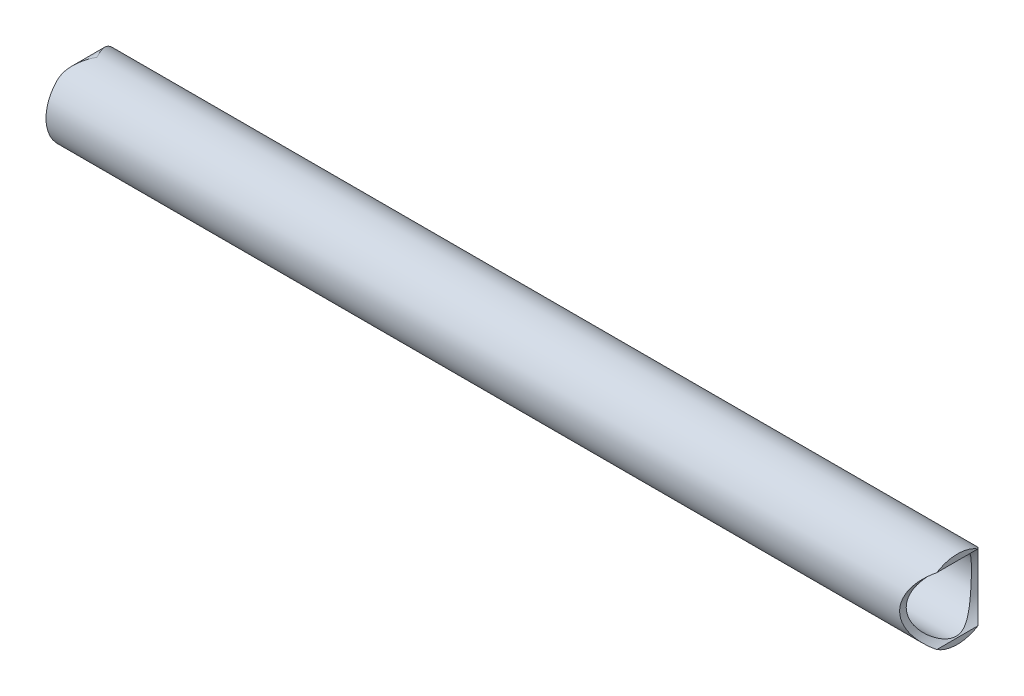
ISO-10303-21;
HEADER;
FILE_DESCRIPTION(('STEP AP214'),'2;1');
FILE_NAME('part.step','',(''),(''),'','','');
FILE_SCHEMA(('AUTOMOTIVE_DESIGN { 1 0 10303 214 1 1 1 1 }'));
ENDSEC;
DATA;
#1=APPLICATION_CONTEXT('core data for automotive mechanical design processes');
#2=APPLICATION_PROTOCOL_DEFINITION('international standard','automotive_design',2000,#1);
#3=PRODUCT_CONTEXT('',#1,'mechanical');
#4=PRODUCT('Part','Part','',(#3));
#5=PRODUCT_RELATED_PRODUCT_CATEGORY('part','',(#4));
#6=PRODUCT_DEFINITION_FORMATION('','',#4);
#7=PRODUCT_DEFINITION_CONTEXT('part definition',#1,'design');
#8=PRODUCT_DEFINITION('design','',#6,#7);
#9=PRODUCT_DEFINITION_SHAPE('','',#8);
#10=(LENGTH_UNIT() NAMED_UNIT(*) SI_UNIT(.MILLI.,.METRE.));
#11=(NAMED_UNIT(*) PLANE_ANGLE_UNIT() SI_UNIT($,.RADIAN.));
#12=(NAMED_UNIT(*) SI_UNIT($,.STERADIAN.) SOLID_ANGLE_UNIT());
#13=UNCERTAINTY_MEASURE_WITH_UNIT(LENGTH_MEASURE(1.E-05),#10,'distance_accuracy_value','');
#14=(GEOMETRIC_REPRESENTATION_CONTEXT(3) GLOBAL_UNCERTAINTY_ASSIGNED_CONTEXT((#13)) GLOBAL_UNIT_ASSIGNED_CONTEXT((#10,
#11,#12)) REPRESENTATION_CONTEXT('',''));
#15=CARTESIAN_POINT('',(0.,0.,0.));
#16=DIRECTION('',(0.,0.,1.));
#17=DIRECTION('',(1.,0.,0.));
#18=AXIS2_PLACEMENT_3D('',#15,#16,#17);
#19=CARTESIAN_POINT('',(469.10625,0.,0.));
#20=DIRECTION('',(1.,0.,0.));
#21=DIRECTION('',(0.,0.,-1.));
#22=AXIS2_PLACEMENT_3D('',#19,#20,#21);
#23=PLANE('',#22);
#24=DIRECTION('',(0.,0.,1.));
#25=VECTOR('',#24,1.);
#26=CARTESIAN_POINT('',(469.10625,17.9154421589309,-21.082));
#27=LINE('',#26,#25);
#28=CARTESIAN_POINT('',(469.10625,17.9154421589309,-11.1125));
#29=VERTEX_POINT('',#28);
#30=CARTESIAN_POINT('',(469.10625,17.915442158931,11.1125));
#31=VERTEX_POINT('',#30);
#32=EDGE_CURVE('E86',#29,#31,#27,.T.);
#33=ORIENTED_EDGE('',*,*,#32,.F.);
#34=CARTESIAN_POINT('',(469.10625,0.,0.));
#35=DIRECTION('',(1.,0.,0.));
#36=DIRECTION('',(0.,0.,-1.));
#37=AXIS2_PLACEMENT_3D('',#34,#35,#36);
#38=CIRCLE('',#37,21.082);
#39=EDGE_CURVE('E46',#29,#31,#38,.T.);
#40=ORIENTED_EDGE('',*,*,#39,.T.);
#41=EDGE_LOOP('',(#33,#40));
#42=FACE_BOUND('',#41,.T.);
#43=ADVANCED_FACE('F32',(#42),#23,.T.);
#44=DIRECTION('',(0.,0.,1.));
#45=VECTOR('',#44,1.);
#46=CARTESIAN_POINT('',(469.10625,-17.9154421589309,-21.082));
#47=LINE('',#46,#45);
#48=CARTESIAN_POINT('',(469.10625,-17.915442158931,11.1125));
#49=VERTEX_POINT('',#48);
#50=CARTESIAN_POINT('',(469.10625,-17.9154421589309,-11.1125));
#51=VERTEX_POINT('',#50);
#52=EDGE_CURVE('E83',#49,#51,#47,.F.);
#53=ORIENTED_EDGE('',*,*,#52,.F.);
#54=EDGE_CURVE('E91',#49,#51,#38,.T.);
#55=ORIENTED_EDGE('',*,*,#54,.T.);
#56=EDGE_LOOP('',(#53,#55));
#57=FACE_BOUND('',#56,.T.);
#58=ADVANCED_FACE('F90',(#57),#23,.T.);
#59=CARTESIAN_POINT('',(0.,0.,0.));
#60=DIRECTION('',(1.,0.,0.));
#61=DIRECTION('',(0.,0.,-1.));
#62=AXIS2_PLACEMENT_3D('',#59,#60,#61);
#63=PLANE('',#62);
#64=CARTESIAN_POINT('',(0.,0.,0.));
#65=DIRECTION('',(1.,0.,0.));
#66=DIRECTION('',(0.,0.,-1.));
#67=AXIS2_PLACEMENT_3D('',#64,#65,#66);
#68=CIRCLE('',#67,21.082);
#69=CARTESIAN_POINT('',(0.,14.732,15.0804144505382));
#70=VERTEX_POINT('',#69);
#71=CARTESIAN_POINT('',(0.,14.732,-15.0804144505382));
#72=VERTEX_POINT('',#71);
#73=EDGE_CURVE('E94',#70,#72,#68,.T.);
#74=ORIENTED_EDGE('',*,*,#73,.F.);
#75=DIRECTION('',(0.,0.,1.));
#76=VECTOR('',#75,1.);
#77=CARTESIAN_POINT('',(0.,14.732,-21.082));
#78=LINE('',#77,#76);
#79=CARTESIAN_POINT('',(0.,14.732,9.49362164824362));
#80=VERTEX_POINT('',#79);
#81=EDGE_CURVE('E122',#80,#70,#78,.T.);
#82=ORIENTED_EDGE('',*,*,#81,.F.);
#83=CARTESIAN_POINT('',(0.,0.,0.));
#84=DIRECTION('',(1.,0.,0.));
#85=DIRECTION('',(0.,0.,-1.));
#86=AXIS2_PLACEMENT_3D('',#83,#84,#85);
#87=CIRCLE('',#86,17.526);
#88=CARTESIAN_POINT('',(0.,14.732,-9.49362164824362));
#89=VERTEX_POINT('',#88);
#90=EDGE_CURVE('E97',#80,#89,#87,.T.);
#91=ORIENTED_EDGE('',*,*,#90,.T.);
#92=EDGE_CURVE('E60',#72,#89,#78,.T.);
#93=ORIENTED_EDGE('',*,*,#92,.F.);
#94=EDGE_LOOP('',(#74,#82,#91,#93));
#95=FACE_BOUND('',#94,.T.);
#96=ADVANCED_FACE('F134',(#95),#63,.F.);
#97=CARTESIAN_POINT('',(469.10625,0.,0.));
#98=DIRECTION('',(-1.,0.,0.));
#99=DIRECTION('',(0.,0.,1.));
#100=AXIS2_PLACEMENT_3D('',#97,#98,#99);
#101=CYLINDRICAL_SURFACE('',#100,21.082);
#102=ORIENTED_EDGE('',*,*,#73,.T.);
#103=CARTESIAN_POINT('',(0.,14.732,-15.0804144505382));
#104=CARTESIAN_POINT('',(4.99777097256306E-06,14.8585166363932,-14.9568250218965));
#105=CARTESIAN_POINT('',(0.0037804024379681,14.9834433145249,-14.8316684363902));
#106=CARTESIAN_POINT('',(0.018344612519162,15.2298802862784,-14.578499414352));
#107=CARTESIAN_POINT('',(0.0291313987626797,15.3513915529794,-14.4504878102679));
#108=CARTESIAN_POINT('',(0.0711641868780703,15.7100653220193,-14.0630095037458));
#109=CARTESIAN_POINT('',(0.112087001365868,15.9418874425845,-13.7995912481011));
#110=CARTESIAN_POINT('',(0.215488507432889,16.3879660671565,-13.2666880799684));
#111=CARTESIAN_POINT('',(0.277765297706076,16.6023646270495,-12.997281336883));
#112=CARTESIAN_POINT('',(0.420807437337394,17.0156387002352,-12.4513482602452));
#113=CARTESIAN_POINT('',(0.501584818248204,17.2145039983668,-12.1748173979638));
#114=CARTESIAN_POINT('',(0.722336490267377,17.6901137279932,-11.4788940830607));
#115=CARTESIAN_POINT('',(0.871915178025879,17.9572278098856,-11.0559422302578));
#116=CARTESIAN_POINT('',(1.19848542775072,18.4567086453977,-10.2003069203716));
#117=CARTESIAN_POINT('',(1.37548494857253,18.6890652721093,-9.76762066916));
#118=CARTESIAN_POINT('',(1.75209895067343,19.1211226362083,-8.89229878891464));
#119=CARTESIAN_POINT('',(1.9518397925665,19.3206241773796,-8.4496197349844));
#120=CARTESIAN_POINT('',(2.36824696498252,19.6862817768882,-7.55863388229215));
#121=CARTESIAN_POINT('',(2.58491234738668,19.8524397012882,-7.11032739995988));
#122=CARTESIAN_POINT('',(3.07854021979459,20.1841782782303,-6.11397748165988));
#123=CARTESIAN_POINT('',(3.35855407719812,20.3421826858222,-5.56492077807607));
#124=CARTESIAN_POINT('',(3.93195657278609,20.6121360645314,-4.46237555433802));
#125=CARTESIAN_POINT('',(4.2253492325938,20.7240710846151,-3.90888574337448));
#126=CARTESIAN_POINT('',(4.81966564824809,20.9026212412311,-2.80091191808466));
#127=CARTESIAN_POINT('',(5.12056407013035,20.9693718110366,-2.24643591433334));
#128=CARTESIAN_POINT('',(5.7263441140806,21.0587059818151,-1.13639917411688));
#129=CARTESIAN_POINT('',(6.0312234277849,21.0813141259917,-0.580839212441869));
#130=CARTESIAN_POINT('',(6.34068566822062,21.0819948744209,-0.0169715207830517));
#131=CARTESIAN_POINT('',(6.34534284661023,21.081999997751,-0.00848573804402203));
#132=CARTESIAN_POINT('',(6.35,21.082,0.));
#133=B_SPLINE_CURVE_WITH_KNOTS('',3,(#103,#104,#105,#106,#107,#108,#109,#110,#111,#112,#113,
#114,#115,#116,#117,#118,#119,#120,#121,#122,#123,#124,#125,#126,#127,#128,#129,#130,#131,#132),
.UNSPECIFIED.,.F.,.F.,(4,2,2,2,2,2,2,2,2,2,2,2,2,2,4),(0.,0.530465682198346,1.06077866603508,
2.11923257632368,3.16794284977036,4.21733708093636,5.78132496799527,7.34576765361523,
8.91937150261676,10.4928872609037,12.3996794344843,14.3070486112538,16.2086751300639,
18.1092440424708,18.1382833302831),.UNSPECIFIED.);
#134=CARTESIAN_POINT('',(6.35,21.082,0.));
#135=VERTEX_POINT('',#134);
#136=EDGE_CURVE('E121',#72,#135,#133,.T.);
#137=ORIENTED_EDGE('',*,*,#136,.T.);
#138=CARTESIAN_POINT('',(0.,14.732,15.0804144505382));
#139=CARTESIAN_POINT('',(4.99777097265902E-06,14.8585166363932,14.9568250218965));
#140=CARTESIAN_POINT('',(0.00378040243796859,14.983443314525,14.8316684363902));
#141=CARTESIAN_POINT('',(0.0183446125191639,15.2298802862785,14.5784994143519));
#142=CARTESIAN_POINT('',(0.0291313987626825,15.3513915529794,14.4504878102678));
#143=CARTESIAN_POINT('',(0.071164186878077,15.7100653220194,14.0630095037458));
#144=CARTESIAN_POINT('',(0.112087001365878,15.9418874425845,13.799591248101));
#145=CARTESIAN_POINT('',(0.215488507432905,16.3879660671565,13.2666880799683));
#146=CARTESIAN_POINT('',(0.277765297706091,16.6023646270495,12.9972813368829));
#147=CARTESIAN_POINT('',(0.420807437337405,17.0156387002352,12.4513482602451));
#148=CARTESIAN_POINT('',(0.501584818248212,17.2145039983668,12.1748173979638));
#149=CARTESIAN_POINT('',(0.722336490267378,17.6901137279932,11.4788940830607));
#150=CARTESIAN_POINT('',(0.871915178025876,17.9572278098856,11.0559422302578));
#151=CARTESIAN_POINT('',(1.19848542775071,18.4567086453976,10.2003069203717));
#152=CARTESIAN_POINT('',(1.37548494857251,18.6890652721093,9.76762066916005));
#153=CARTESIAN_POINT('',(1.75209895067341,19.1211226362082,8.89229878891469));
#154=CARTESIAN_POINT('',(1.95183979256649,19.3206241773795,8.44961973498444));
#155=CARTESIAN_POINT('',(2.36824696498251,19.6862817768881,7.55863388229216));
#156=CARTESIAN_POINT('',(2.58491234738667,19.8524397012882,7.11032739995988));
#157=CARTESIAN_POINT('',(3.0785402197946,20.1841782782303,6.11397748165988));
#158=CARTESIAN_POINT('',(3.35855407719814,20.3421826858222,5.56492077807609));
#159=CARTESIAN_POINT('',(3.93195657278606,20.6121360645314,4.462375554338));
#160=CARTESIAN_POINT('',(4.22534923259369,20.7240710846151,3.90888574337441));
#161=CARTESIAN_POINT('',(4.81966564824822,20.9026212412311,2.80091191808473));
#162=CARTESIAN_POINT('',(5.12056407013078,20.9693718110366,2.24643591433359));
#163=CARTESIAN_POINT('',(5.72634411408013,21.0587059818151,1.13639917411665));
#164=CARTESIAN_POINT('',(6.03122342778322,21.0813141259917,0.580839212440988));
#165=CARTESIAN_POINT('',(6.34068566822056,21.0819948744209,0.0169715207830728));
#166=CARTESIAN_POINT('',(6.3453428466102,21.081999997751,0.00848573804405541));
#167=CARTESIAN_POINT('',(6.35,21.082,0.));
#168=B_SPLINE_CURVE_WITH_KNOTS('',3,(#138,#139,#140,#141,#142,#143,#144,#145,#146,#147,#148,
#149,#150,#151,#152,#153,#154,#155,#156,#157,#158,#159,#160,#161,#162,#163,#164,#165,#166,#167),
.UNSPECIFIED.,.F.,.F.,(4,2,2,2,2,2,2,2,2,2,2,2,2,2,4),(0.,0.530465682198373,1.06077866603513,
2.11923257632378,3.16794284977042,4.21733708093637,5.78132496799524,7.34576765361516,
8.91937150261673,10.4928872609037,12.3996794344843,14.3070486112539,16.2086751300639,
18.1092440424708,18.1382833302831),.UNSPECIFIED.);
#169=EDGE_CURVE('E115',#135,#70,#168,.F.);
#170=ORIENTED_EDGE('',*,*,#169,.T.);
#171=EDGE_LOOP('',(#102,#137,#170));
#172=FACE_BOUND('',#171,.T.);
#173=ORIENTED_EDGE('',*,*,#39,.F.);
#174=CARTESIAN_POINT('',(480.21875,0.,0.));
#175=DIRECTION('',(-0.707106781186548,0.,0.707106781186547));
#176=DIRECTION('',(-0.707106781186548,0.,-0.707106781186547));
#177=AXIS2_PLACEMENT_3D('',#174,#175,#176);
#178=ELLIPSE('',#177,29.8144503219496,21.082);
#179=EDGE_CURVE('E93',#29,#51,#178,.T.);
#180=ORIENTED_EDGE('',*,*,#179,.T.);
#181=ORIENTED_EDGE('',*,*,#54,.F.);
#182=CARTESIAN_POINT('',(480.21875,0.,0.));
#183=DIRECTION('',(-0.707106781186548,0.,-0.707106781186547));
#184=DIRECTION('',(-0.707106781186548,0.,0.707106781186547));
#185=AXIS2_PLACEMENT_3D('',#182,#183,#184);
#186=ELLIPSE('',#185,29.8144503219496,21.082);
#187=EDGE_CURVE('E53',#49,#31,#186,.T.);
#188=ORIENTED_EDGE('',*,*,#187,.T.);
#189=EDGE_LOOP('',(#173,#180,#181,#188));
#190=FACE_BOUND('',#189,.T.);
#191=ADVANCED_FACE('F34',(#172,#190),#101,.T.);
#192=CARTESIAN_POINT('',(469.10625,0.,0.));
#193=DIRECTION('',(-1.,0.,0.));
#194=DIRECTION('',(0.,0.,1.));
#195=AXIS2_PLACEMENT_3D('',#192,#193,#194);
#196=CYLINDRICAL_SURFACE('',#195,17.526);
#197=CARTESIAN_POINT('',(459.13675,0.,17.526));
#198=CARTESIAN_POINT('',(459.136753100232,0.416555730228906,17.525996813955));
#199=CARTESIAN_POINT('',(459.149123313981,0.833163012071545,17.5111221446535));
#200=CARTESIAN_POINT('',(459.198320724751,1.66285085098589,17.4518957288154));
#201=CARTESIAN_POINT('',(459.235152005793,2.0759308074684,17.4075390599622));
#202=CARTESIAN_POINT('',(459.332452439066,2.89546158233793,17.2901260170745));
#203=CARTESIAN_POINT('',(459.392938843433,3.30190733638105,17.2170486963236));
#204=CARTESIAN_POINT('',(459.536212942405,4.10484124386305,17.0434647188049));
#205=CARTESIAN_POINT('',(459.619000210819,4.50132958743919,16.9429585862272));
#206=CARTESIAN_POINT('',(459.804608337995,5.27944797465432,16.7167963170662));
#207=CARTESIAN_POINT('',(459.907303655403,5.66115402240748,16.5912976561353));
#208=CARTESIAN_POINT('',(460.13114125938,6.41026860382347,16.3165047587702));
#209=CARTESIAN_POINT('',(460.252283245215,6.77767737045173,16.1672109102661));
#210=CARTESIAN_POINT('',(460.510997114563,7.49674702968466,15.8465909890381));
#211=CARTESIAN_POINT('',(460.648570010029,7.84840695050787,15.6752635592522));
#212=CARTESIAN_POINT('',(460.938082247339,8.53495429518089,15.3122852034019));
#213=CARTESIAN_POINT('',(461.090024633481,8.86983814178559,15.1206299696701));
#214=CARTESIAN_POINT('',(461.464140089599,9.64160099861961,14.6449374869007));
#215=CARTESIAN_POINT('',(461.691652769384,10.0709113512938,14.3527749107548));
#216=CARTESIAN_POINT('',(462.164488465582,10.8958978241818,13.7370028939555));
#217=CARTESIAN_POINT('',(462.409817485787,11.2915625079794,13.4133828401386));
#218=CARTESIAN_POINT('',(462.913798875036,12.049775776248,12.7366579401323));
#219=CARTESIAN_POINT('',(463.17248335067,12.4122381349312,12.3834806406871));
#220=CARTESIAN_POINT('',(463.697391944567,13.102805813699,11.6503545982694));
#221=CARTESIAN_POINT('',(463.963615114459,13.4309154311957,11.2704092138659));
#222=CARTESIAN_POINT('',(464.503016862729,14.0584742968281,10.4776077506457));
#223=CARTESIAN_POINT('',(464.776233749344,14.3572918160694,10.0642778803075));
#224=CARTESIAN_POINT('',(465.318313078632,14.9191165849368,9.21095532717234));
#225=CARTESIAN_POINT('',(465.587174038226,15.1821118547605,8.77095379548327));
#226=CARTESIAN_POINT('',(466.111691041438,15.6706637077535,7.86481925902692));
#227=CARTESIAN_POINT('',(466.367377460908,15.8963093356672,7.39875205622169));
#228=CARTESIAN_POINT('',(466.855669817722,16.3089147666568,6.43838077354218));
#229=CARTESIAN_POINT('',(467.088295378546,16.4959076106971,5.94410127510899));
#230=CARTESIAN_POINT('',(467.419892415188,16.7529770224336,5.15602712210236));
#231=CARTESIAN_POINT('',(467.531806838252,16.837735543251,4.872411200417));
#232=CARTESIAN_POINT('',(467.741705453925,16.9938564773723,4.29634473218566));
#233=CARTESIAN_POINT('',(467.83968784338,17.0652171570416,4.00389304799845));
#234=CARTESIAN_POINT('',(468.018453347219,17.1934754104678,3.41127303424146));
#235=CARTESIAN_POINT('',(468.099269928926,17.2504011700851,3.11112102298287));
#236=CARTESIAN_POINT('',(468.240783138788,17.3489622258268,2.503748224318));
#237=CARTESIAN_POINT('',(468.301490351692,17.3906055672393,2.19653124698383));
#238=CARTESIAN_POINT('',(468.400642338332,17.4581424184477,1.57275012439623));
#239=CARTESIAN_POINT('',(468.438798088988,17.4838316609619,1.25611705495765));
#240=CARTESIAN_POINT('',(468.489564384314,17.517930419636,0.619877416859227));
#241=CARTESIAN_POINT('',(468.502177230519,17.526341492641,0.300271118708478));
#242=CARTESIAN_POINT('',(468.501123738161,17.5256372212721,-0.338900631657943));
#243=CARTESIAN_POINT('',(468.487455708289,17.5165207489109,-0.658466079921118));
#244=CARTESIAN_POINT('',(468.434638550502,17.4810304342677,-1.29450990358539));
#245=CARTESIAN_POINT('',(468.395486264212,17.454654452937,-1.61098789140883));
#246=CARTESIAN_POINT('',(468.289324257895,17.3822895125155,-2.26597180787558));
#247=CARTESIAN_POINT('',(468.220160695607,17.3347748801548,-2.6039563959663));
#248=CARTESIAN_POINT('',(468.05798050578,17.2213863424108,-3.27094152568147));
#249=CARTESIAN_POINT('',(467.964960013026,17.1555094618906,-3.59994060193884));
#250=CARTESIAN_POINT('',(467.758998964524,17.0065131076897,-4.24855727345));
#251=CARTESIAN_POINT('',(467.64600613574,16.9233482836622,-4.56814761827544));
#252=CARTESIAN_POINT('',(467.404253660727,16.7410384013215,-5.19667563423267));
#253=CARTESIAN_POINT('',(467.275487866865,16.6418871073676,-5.50560909125264));
#254=CARTESIAN_POINT('',(466.927147015409,16.3663636741079,-6.28987340285503));
#255=CARTESIAN_POINT('',(466.698405644521,16.1786783054546,-6.75718011774374));
#256=CARTESIAN_POINT('',(466.221976191773,15.7683263145676,-7.66612047395263));
#257=CARTESIAN_POINT('',(465.974277188512,15.5456394491178,-8.10773905469757));
#258=CARTESIAN_POINT('',(465.468372952079,15.0664754392744,-8.96683638051191));
#259=CARTESIAN_POINT('',(465.21015403316,14.8099532398125,-9.38428185098054));
#260=CARTESIAN_POINT('',(464.690466965766,14.2641231324516,-10.1948087082538));
#261=CARTESIAN_POINT('',(464.428999471574,13.9748217341554,-10.5878949086503));
#262=CARTESIAN_POINT('',(463.895324879337,13.348195218157,-11.368790869149));
#263=CARTESIAN_POINT('',(463.623240901127,13.0091843032674,-11.7553355433847));
#264=CARTESIAN_POINT('',(463.087541373633,12.2951909614096,-12.5002060187878));
#265=CARTESIAN_POINT('',(462.823927094039,11.9202031744408,-12.8585276006225));
#266=CARTESIAN_POINT('',(462.311174827839,11.1350258886843,-13.5441070863272));
#267=CARTESIAN_POINT('',(462.062010084927,10.7249051788906,-13.8714231651622));
#268=CARTESIAN_POINT('',(461.7029705029,10.0834868401277,-14.3371461507588));
#269=CARTESIAN_POINT('',(461.585752726259,9.8653306424743,-14.4881649831134));
#270=CARTESIAN_POINT('',(461.356837871324,9.42027707168284,-14.7814103315513));
#271=CARTESIAN_POINT('',(461.245142151037,9.19337757252926,-14.9236346869964));
#272=CARTESIAN_POINT('',(460.973493112914,8.61498224084044,-15.2678084182525));
#273=CARTESIAN_POINT('',(460.817459068209,8.25811349099297,-15.4639027842676));
#274=CARTESIAN_POINT('',(460.521964191443,7.52616004996061,-15.8330525436508));
#275=CARTESIAN_POINT('',(460.382499423159,7.15107971509298,-16.0061134100713));
#276=CARTESIAN_POINT('',(460.122537175912,6.38410638575886,-16.3271734823368));
#277=CARTESIAN_POINT('',(460.00203301395,5.99221937735624,-16.4751815198914));
#278=CARTESIAN_POINT('',(459.782250109816,5.19343454244432,-16.7441479493523));
#279=CARTESIAN_POINT('',(459.682971726726,4.78653646212599,-16.8651058836479));
#280=CARTESIAN_POINT('',(459.507089403541,3.95712937963007,-17.0788335101842));
#281=CARTESIAN_POINT('',(459.430663185674,3.53452536865489,-17.1713824047497));
#282=CARTESIAN_POINT('',(459.30330895774,2.67986601870688,-17.325342710614));
#283=CARTESIAN_POINT('',(459.252380994275,2.24781066246181,-17.3867540650041));
#284=CARTESIAN_POINT('',(459.177324216148,1.37821649825806,-17.4771905064637));
#285=CARTESIAN_POINT('',(459.153182158585,0.940680508218323,-17.5062315973617));
#286=CARTESIAN_POINT('',(459.132290012414,0.0640313485043037,-17.5313661812511));
#287=CARTESIAN_POINT('',(459.135537074792,-0.37508165237985,-17.5274631010918));
#288=CARTESIAN_POINT('',(459.167335633984,-1.19930498558239,-17.4891990815668));
#289=CARTESIAN_POINT('',(459.192874675364,-1.58470875998572,-17.4584640327402));
#290=CARTESIAN_POINT('',(459.264684232639,-2.35069997583225,-17.3719144045829));
#291=CARTESIAN_POINT('',(459.310952802018,-2.73128786604044,-17.3161021800126));
#292=CARTESIAN_POINT('',(459.42332254399,-3.48513791526224,-17.1802563891461));
#293=CARTESIAN_POINT('',(459.489424907109,-3.85839963308743,-17.1002213688688));
#294=CARTESIAN_POINT('',(459.64024630486,-4.59536738648546,-16.9170761014037));
#295=CARTESIAN_POINT('',(459.724966273857,-4.95907294143571,-16.813964696073));
#296=CARTESIAN_POINT('',(459.913145504431,-5.68108005964255,-16.5840874699882));
#297=CARTESIAN_POINT('',(460.016895992016,-6.03918783157445,-16.4569529541794));
#298=CARTESIAN_POINT('',(460.240467917882,-6.74203119401674,-16.1817226350541));
#299=CARTESIAN_POINT('',(460.360289050715,-7.08676703852215,-16.033627230131));
#300=CARTESIAN_POINT('',(460.614268706947,-7.7617711253795,-15.7179651464271));
#301=CARTESIAN_POINT('',(460.748429245294,-8.09203732526567,-15.5503957309038));
#302=CARTESIAN_POINT('',(461.029307650088,-8.73727082208682,-15.1972398091077));
#303=CARTESIAN_POINT('',(461.176028031205,-9.05223503545283,-15.0116496938153));
#304=CARTESIAN_POINT('',(461.548812920572,-9.80464712063615,-14.5364034891831));
#305=CARTESIAN_POINT('',(461.780846995919,-10.2333578451482,-14.2375288779349));
#306=CARTESIAN_POINT('',(462.262358234905,-11.0565036944503,-13.6081978996813));
#307=CARTESIAN_POINT('',(462.511842112484,-11.4509254939542,-13.2777293585403));
#308=CARTESIAN_POINT('',(463.023748955069,-12.2062013475731,-12.5869774042746));
#309=CARTESIAN_POINT('',(463.286207884647,-12.5669530526875,-12.2266089972621));
#310=CARTESIAN_POINT('',(463.817996141297,-13.253470559835,-11.4788424530418));
#311=CARTESIAN_POINT('',(464.08732447637,-13.5792413783913,-11.091448204724));
#312=CARTESIAN_POINT('',(464.631962798302,-14.2012900820747,-10.2834169092844));
#313=CARTESIAN_POINT('',(464.907294003942,-14.4969406813881,-9.8623113113111));
#314=CARTESIAN_POINT('',(465.452322074852,-15.0517275612925,-8.99289776114401));
#315=CARTESIAN_POINT('',(465.722016777624,-15.3108500388738,-8.54457961710635));
#316=CARTESIAN_POINT('',(466.246222682617,-15.7906628138659,-7.62139093429989));
#317=CARTESIAN_POINT('',(466.500775922646,-16.0114631279653,-7.14660175430663));
#318=CARTESIAN_POINT('',(466.984149383237,-16.4132437140876,-6.16809279152978));
#319=CARTESIAN_POINT('',(467.212994501134,-16.5942626782093,-5.6644017261431));
#320=CARTESIAN_POINT('',(467.533166365567,-16.8388425611419,-4.86810478458098));
#321=CARTESIAN_POINT('',(467.63901918611,-16.9179225696371,-4.58604260557915));
#322=CARTESIAN_POINT('',(467.836250596365,-17.062806654192,-4.01353560636163));
#323=CARTESIAN_POINT('',(467.92763123726,-17.1286126119829,-3.72309198098292));
#324=CARTESIAN_POINT('',(468.092782938295,-17.2459247048064,-3.13503376582409));
#325=CARTESIAN_POINT('',(468.166590343537,-17.2974603903694,-2.83743540296246));
#326=CARTESIAN_POINT('',(468.29389080646,-17.3854671554674,-2.23575303013736));
#327=CARTESIAN_POINT('',(468.347389138256,-17.4219421463683,-1.93167072569972));
#328=CARTESIAN_POINT('',(468.432050986908,-17.4793343349965,-1.31542257105261));
#329=CARTESIAN_POINT('',(468.462959056324,-17.5000736934338,-1.00320440672016));
#330=CARTESIAN_POINT('',(468.499785417953,-17.524756770186,-0.376634351053846));
#331=CARTESIAN_POINT('',(468.505705534394,-17.5287017145648,-0.0622826171578791));
#332=CARTESIAN_POINT('',(468.492219236601,-17.519682115217,0.565765427557123));
#333=CARTESIAN_POINT('',(468.472801625762,-17.5067100959756,0.87946138722474));
#334=CARTESIAN_POINT('',(468.409708218613,-17.4642111799082,1.50326166249684));
#335=CARTESIAN_POINT('',(468.366029014212,-17.4346819572413,1.8133654672525));
#336=CARTESIAN_POINT('',(468.24947913328,-17.3549094765865,2.46783373112703));
#337=CARTESIAN_POINT('',(468.173539424602,-17.302463431889,2.81137909094881));
#338=CARTESIAN_POINT('',(467.99769360765,-17.1787080018257,3.48874159064592));
#339=CARTESIAN_POINT('',(467.897782550923,-17.1073947213456,3.82255670590954));
#340=CARTESIAN_POINT('',(467.678186596836,-16.947078987979,4.48018532937914));
#341=CARTESIAN_POINT('',(467.55845074705,-16.8580308311813,4.80397044519033));
#342=CARTESIAN_POINT('',(467.303531095877,-16.6635408359202,5.44039078400235));
#343=CARTESIAN_POINT('',(467.168341323107,-16.5580926547885,5.75302163536546));
#344=CARTESIAN_POINT('',(466.803678142386,-16.2655608949425,6.54686642927639));
#345=CARTESIAN_POINT('',(466.565311783285,-16.0668060807317,7.0197186237903));
#346=CARTESIAN_POINT('',(466.070778251224,-15.6331071713109,7.93883090279246));
#347=CARTESIAN_POINT('',(465.814601013657,-15.3981425218364,8.38507568297595));
#348=CARTESIAN_POINT('',(465.292991177891,-14.8931005076266,9.25247800104897));
#349=CARTESIAN_POINT('',(465.027546784682,-14.6229771058186,9.67360157184695));
#350=CARTESIAN_POINT('',(464.49479644847,-14.0485414814654,10.4903942108924));
#351=CARTESIAN_POINT('',(464.227490886297,-13.7442360709218,10.8860683262347));
#352=CARTESIAN_POINT('',(463.685008627962,-13.0872302237909,11.6686564771624));
#353=CARTESIAN_POINT('',(463.410011314537,-12.7329783860628,12.0543962817461));
#354=CARTESIAN_POINT('',(462.870324829164,-11.9872775461265,12.7961902436962));
#355=CARTESIAN_POINT('',(462.60563734665,-11.5958224834142,13.1522395466039));
#356=CARTESIAN_POINT('',(462.092856716602,-10.776623787392,13.8313916713883));
#357=CARTESIAN_POINT('',(461.844731277596,-10.3489546907981,14.1545592898452));
#358=CARTESIAN_POINT('',(461.489058671317,-9.6805538418048,14.6123392874479));
#359=CARTESIAN_POINT('',(461.373266967441,-9.45330032462178,14.7604208100894));
#360=CARTESIAN_POINT('',(461.147843154438,-8.98986303225831,15.0471693205303));
#361=CARTESIAN_POINT('',(461.03821252428,-8.7536771354263,15.1858340494738));
#362=CARTESIAN_POINT('',(460.777882456114,-8.16388969440334,15.5135810654738));
#363=CARTESIAN_POINT('',(460.631019615212,-7.80547285234025,15.6971201066552));
#364=CARTESIAN_POINT('',(460.354258282389,-7.07152507053722,16.0411475968501));
#365=CARTESIAN_POINT('',(460.224355748624,-6.69599823719479,16.2016415386992));
#366=CARTESIAN_POINT('',(459.983865788701,-5.92969186792639,16.4975121757086));
#367=CARTESIAN_POINT('',(459.873255954141,-5.53893068115682,16.6329180221441));
#368=CARTESIAN_POINT('',(459.673317296928,-4.74382214338575,16.8768969338328));
#369=CARTESIAN_POINT('',(459.583984673672,-4.33947723349805,16.9854747913174));
#370=CARTESIAN_POINT('',(459.445844180231,-3.61139042732534,17.1529959877094));
#371=CARTESIAN_POINT('',(459.392441530083,-3.2898093654496,17.2176086822695));
#372=CARTESIAN_POINT('',(459.300313709527,-2.64139463379433,17.3289327236608));
#373=CARTESIAN_POINT('',(459.261591366206,-2.31455996491102,17.3756406224611));
#374=CARTESIAN_POINT('',(459.199400717763,-1.657300955975,17.4505998410856));
#375=CARTESIAN_POINT('',(459.175933854947,-1.32687627951213,17.4788494157967));
#376=CARTESIAN_POINT('',(459.144609151471,-0.66431170552806,17.5165484873698));
#377=CARTESIAN_POINT('',(459.136747527795,-0.332172243283639,17.5260025406341));
#378=CARTESIAN_POINT('',(459.13675,0.,17.526));
#379=B_SPLINE_CURVE_WITH_KNOTS('',3,(#197,#198,#199,#200,#201,#202,#203,#204,#205,#206,#207,
#208,#209,#210,#211,#212,#213,#214,#215,#216,#217,#218,#219,#220,#221,#222,#223,#224,#225,#226,
#227,#228,#229,#230,#231,#232,#233,#234,#235,#236,#237,#238,#239,#240,#241,#242,#243,#244,#245,
#246,#247,#248,#249,#250,#251,#252,#253,#254,#255,#256,#257,#258,#259,#260,#261,#262,#263,#264,
#265,#266,#267,#268,#269,#270,#271,#272,#273,#274,#275,#276,#277,#278,#279,#280,#281,#282,#283,
#284,#285,#286,#287,#288,#289,#290,#291,#292,#293,#294,#295,#296,#297,#298,#299,#300,#301,#302,
#303,#304,#305,#306,#307,#308,#309,#310,#311,#312,#313,#314,#315,#316,#317,#318,#319,#320,#321,
#322,#323,#324,#325,#326,#327,#328,#329,#330,#331,#332,#333,#334,#335,#336,#337,#338,#339,#340,
#341,#342,#343,#344,#345,#346,#347,#348,#349,#350,#351,#352,#353,#354,#355,#356,#357,#358,#359,
#360,#361,#362,#363,#364,#365,#366,#367,#368,#369,#370,#371,#372,#373,#374,#375,#376,#377,#378),
.UNSPECIFIED.,.T.,.F.,(4,2,2,2,2,2,2,2,2,2,2,2,2,2,2,2,2,2,2,2,2,2,2,2,2,2,2,2,2,2,2,2,2,2,2,2,
2,2,2,2,2,2,2,2,2,2,2,2,2,2,2,2,2,2,2,2,2,2,2,2,2,2,2,2,2,2,2,2,2,2,2,2,2,2,2,2,2,2,2,2,2,2,2,2,
2,2,2,2,2,2,4),(0.,1.24931215514068,2.49883294793602,3.74926674484587,4.99967664647633,
6.24244384055415,7.48519077601582,8.72801428973392,9.97110169852848,11.6694991969452,
13.3684717049052,15.0717382323203,16.7747914316099,18.508900041403,20.2435871614538,
21.974077138334,23.7030816933734,24.6518793950268,25.6007997833557,26.5478527733324,
27.4944064783684,28.4528421356183,29.4111914294722,30.3696024000782,31.3281321733839,
32.3712679495731,33.4145728378166,34.4606499010713,35.5071359859366,37.1638893836605,
38.8216045193316,40.4815497807695,42.1411659704712,43.8844508919193,45.6279959405214,
47.3682019789461,48.238133531576,49.1082779678088,50.4151915777868,51.7217940919451,
53.0279350344375,54.3340980714494,55.6501696985348,56.9662437309291,58.2816668085292,
59.5969530576398,60.7579780281908,61.9188940006416,63.0798796712698,64.240923621771,
65.4214962902465,66.6020465231705,67.7827628635306,68.9637161565106,70.6766447530631,
72.3902360758568,74.1088773225334,75.8272717729951,77.5762157648221,79.3258188748362,
81.0703129492533,82.8131027115062,83.7469352207905,84.6806352566832,85.6123870984828,
86.5438968054863,87.4857834704328,88.4276013724583,89.3698355997799,90.3122022187916,
91.3777285366849,92.4434750028669,93.5120043575646,94.5809479956882,96.2751844313667,
97.9703861554526,99.6678303471317,101.364936859805,103.137598327809,104.910549063673,
106.679935458133,107.564410898222,108.449097758104,109.733689326203,111.01797419982,
112.300757301213,113.58331109564,114.579500372221,115.575881394522,116.57235660447,
117.568590219854),.UNSPECIFIED.);
#380=CARTESIAN_POINT('',(459.13675,0.,17.526));
#381=VERTEX_POINT('',#380);
#382=EDGE_CURVE('E37',#381,#381,#379,.T.);
#383=ORIENTED_EDGE('',*,*,#382,.F.);
#384=EDGE_LOOP('',(#383));
#385=FACE_BOUND('',#384,.T.);
#386=CARTESIAN_POINT('',(0.,14.732,-9.49362164824361));
#387=CARTESIAN_POINT('',(1.18215827092096E-05,14.8512065552147,-9.30864758850528));
#388=CARTESIAN_POINT('',(0.00335629290756961,14.966903733683,-9.12145207419103));
#389=CARTESIAN_POINT('',(0.015618373053566,15.191067778283,-8.74302268186063));
#390=CARTESIAN_POINT('',(0.024534469369689,15.2995365978256,-8.55178991342886));
#391=CARTESIAN_POINT('',(0.0468365894807759,15.5089823218411,-8.16580160022169));
#392=CARTESIAN_POINT('',(0.0602176995159619,15.6099673136364,-7.97105014964136));
#393=CARTESIAN_POINT('',(0.0904463086584942,15.8044598611726,-7.57811282719616));
#394=CARTESIAN_POINT('',(0.107294062917175,15.8979668658161,-7.3799267035169));
#395=CARTESIAN_POINT('',(0.161710749515973,16.1677428894095,-6.77922295697602));
#396=CARTESIAN_POINT('',(0.203066270989696,16.3325710230985,-6.37184299640371));
#397=CARTESIAN_POINT('',(0.28865530712156,16.6311343918077,-5.5460775193833));
#398=CARTESIAN_POINT('',(0.332889819449679,16.7648587740876,-5.12768821805969));
#399=CARTESIAN_POINT('',(0.420233364203613,17.0075279308424,-4.25683335736751));
#400=CARTESIAN_POINT('',(0.463124929061231,17.1145638855675,-3.80380674958994));
#401=CARTESIAN_POINT('',(0.519476718498732,17.2479052083383,-3.11843895481312));
#402=CARTESIAN_POINT('',(0.536930761583319,17.2878189125596,-2.88899376313145));
#403=CARTESIAN_POINT('',(0.568518618471742,17.3584967782642,-2.42847866805183));
#404=CARTESIAN_POINT('',(0.582652788803805,17.3892619223255,-2.19740894186361));
#405=CARTESIAN_POINT('',(0.60700831203503,17.4414967310561,-1.73463327297525));
#406=CARTESIAN_POINT('',(0.617239840917754,17.4629905896764,-1.50293059363321));
#407=CARTESIAN_POINT('',(0.633438941414769,17.4967389939057,-1.03872466306625));
#408=CARTESIAN_POINT('',(0.639406934130212,17.5089944519799,-0.806221493184098));
#409=CARTESIAN_POINT('',(0.646841906691908,17.5242321079992,-0.340835958369956));
#410=CARTESIAN_POINT('',(0.648308834845186,17.5272141994432,-0.107953589113738));
#411=CARTESIAN_POINT('',(0.646683444701061,17.5238958672413,0.357727673351307));
#412=CARTESIAN_POINT('',(0.64359113409545,17.5175954592557,0.590526566700303));
#413=CARTESIAN_POINT('',(0.633015011982841,17.4958254842557,1.05357258230511));
#414=CARTESIAN_POINT('',(0.625569519654457,17.4804359133699,1.28382432502859));
#415=CARTESIAN_POINT('',(0.606616305295421,17.4405997328694,1.74338121783046));
#416=CARTESIAN_POINT('',(0.595108185917324,17.416152237328,1.97268627309738));
#417=CARTESIAN_POINT('',(0.555116369049375,17.3293085585805,2.65858155894497));
#418=CARTESIAN_POINT('',(0.521163416818214,17.2534079290171,3.11322070575031));
#419=CARTESIAN_POINT('',(0.443683996229778,17.0661243267718,4.01506176899039));
#420=CARTESIAN_POINT('',(0.400139881988926,16.9546757811965,4.4622483212256));
#421=CARTESIAN_POINT('',(0.31015365623528,16.6970370744889,5.34616265629826));
#422=CARTESIAN_POINT('',(0.263712022198695,16.5508526263209,5.78289214600579));
#423=CARTESIAN_POINT('',(0.190296116221632,16.2789916862365,6.49992819615105));
#424=CARTESIAN_POINT('',(0.162003200675152,16.1627907207943,6.78372963515089));
#425=CARTESIAN_POINT('',(0.109990072823221,15.9155254057193,7.34511810644267));
#426=CARTESIAN_POINT('',(0.0862682339282398,15.7844663697057,7.62270731812361));
#427=CARTESIAN_POINT('',(0.0460592939801918,15.5080873202831,8.17029076843601));
#428=CARTESIAN_POINT('',(0.0295522145321793,15.3628080690132,8.44030401764001));
#429=CARTESIAN_POINT('',(0.00654051357353983,15.0579847067746,8.9728539714487));
#430=CARTESIAN_POINT('',(4.36685221627461E-05,14.898429607302,9.23538470802819));
#431=CARTESIAN_POINT('',(0.,14.732,9.49362164824361));
#432=B_SPLINE_CURVE_WITH_KNOTS('',3,(#386,#387,#388,#389,#390,#391,#392,#393,#394,#395,#396,
#397,#398,#399,#400,#401,#402,#403,#404,#405,#406,#407,#408,#409,#410,#411,#412,#413,#414,#415,
#416,#417,#418,#419,#420,#421,#422,#423,#424,#425,#426,#427,#428,#429,#430,#431),.UNSPECIFIED.,
.F.,.F.,(4,2,2,2,2,2,2,2,2,2,2,2,2,2,2,2,2,2,2,2,2,2,4),(0.,0.660061225427474,1.31994334467436,
1.97910164384406,2.6383084756313,3.96109639181251,5.2843451659066,6.68505552254074,
7.38551890925716,8.08590703728532,8.78445623939876,9.48293643762741,10.1814246575994,
10.8799116991686,11.5723409064333,12.2648378558842,13.6496257450175,15.0369829791431,
16.4241121943468,17.3476269451524,18.2708124595747,19.1914251291658,20.1127526175606),.UNSPECIFIED.);
#433=EDGE_CURVE('E11',#89,#80,#432,.T.);
#434=ORIENTED_EDGE('',*,*,#433,.F.);
#435=ORIENTED_EDGE('',*,*,#90,.F.);
#436=EDGE_LOOP('',(#434,#435));
#437=FACE_BOUND('',#436,.T.);
#438=ADVANCED_FACE('F105',(#385,#437),#196,.F.);
#439=CARTESIAN_POINT('',(6.35,14.732,-21.082));
#440=DIRECTION('',(0.,0.,1.));
#441=DIRECTION('',(1.,0.,0.));
#442=AXIS2_PLACEMENT_3D('',#439,#440,#441);
#443=CYLINDRICAL_SURFACE('',#442,6.35);
#444=ORIENTED_EDGE('',*,*,#92,.T.);
#445=ORIENTED_EDGE('',*,*,#433,.T.);
#446=ORIENTED_EDGE('',*,*,#81,.T.);
#447=ORIENTED_EDGE('',*,*,#169,.F.);
#448=ORIENTED_EDGE('',*,*,#136,.F.);
#449=EDGE_LOOP('',(#444,#445,#446,#447,#448));
#450=FACE_BOUND('',#449,.T.);
#451=ADVANCED_FACE('F108',(#450),#443,.T.);
#452=CARTESIAN_POINT('',(480.21875,0.,-21.082));
#453=DIRECTION('',(0.,0.,1.));
#454=DIRECTION('',(1.,0.,0.));
#455=AXIS2_PLACEMENT_3D('',#452,#453,#454);
#456=CYLINDRICAL_SURFACE('',#455,21.082);
#457=ORIENTED_EDGE('',*,*,#382,.T.);
#458=EDGE_LOOP('',(#457));
#459=FACE_BOUND('',#458,.T.);
#460=ORIENTED_EDGE('',*,*,#32,.T.);
#461=ORIENTED_EDGE('',*,*,#187,.F.);
#462=ORIENTED_EDGE('',*,*,#52,.T.);
#463=ORIENTED_EDGE('',*,*,#179,.F.);
#464=EDGE_LOOP('',(#460,#461,#462,#463));
#465=FACE_BOUND('',#464,.T.);
#466=ADVANCED_FACE('F82',(#459,#465),#456,.F.);
#467=CLOSED_SHELL('',(#43,#58,#96,#191,#438,#451,#466));
#468=MANIFOLD_SOLID_BREP('B2',#467);
#469=ADVANCED_BREP_SHAPE_REPRESENTATION('',(#18,#468),#14);
#470=SHAPE_DEFINITION_REPRESENTATION(#9,#469);
ENDSEC;
END-ISO-10303-21;
